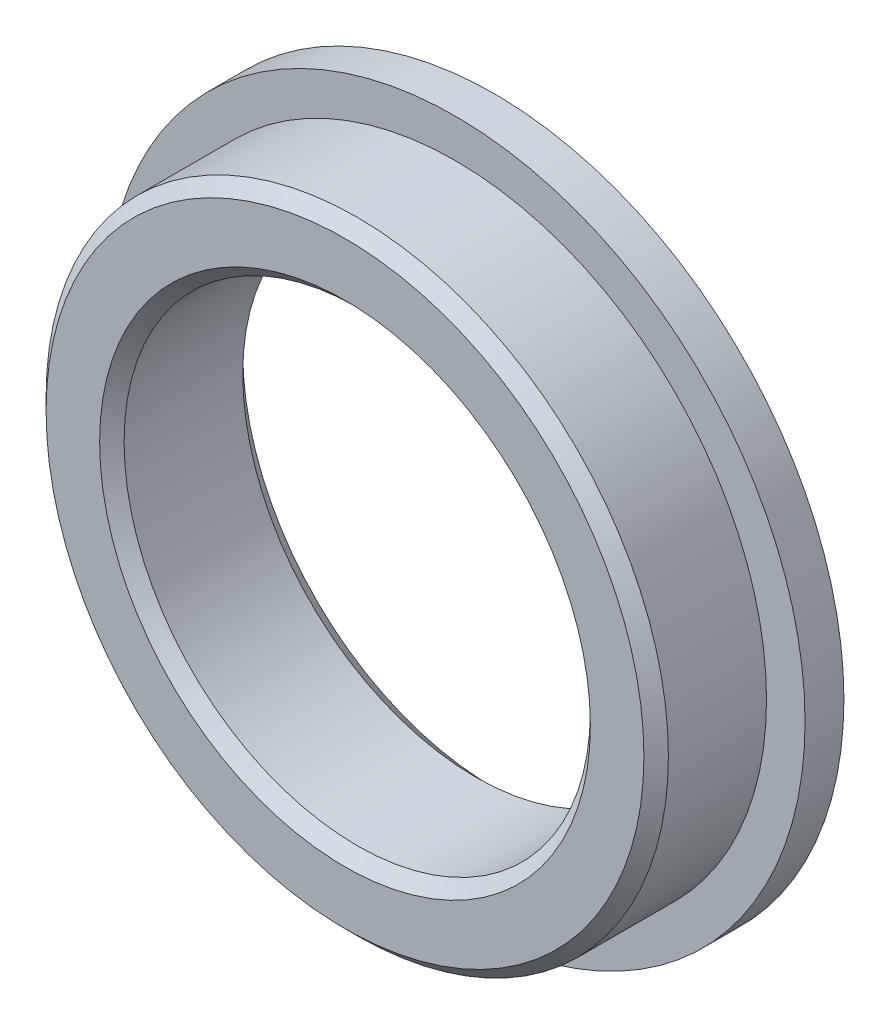
ISO-10303-21;
HEADER;
FILE_DESCRIPTION(('STEP AP214'),'2;1');
FILE_NAME('part.step','',(''),(''),'','','');
FILE_SCHEMA(('AUTOMOTIVE_DESIGN { 1 0 10303 214 1 1 1 1 }'));
ENDSEC;
DATA;
#1=APPLICATION_CONTEXT('core data for automotive mechanical design processes');
#2=APPLICATION_PROTOCOL_DEFINITION('international standard','automotive_design',2000,#1);
#3=PRODUCT_CONTEXT('',#1,'mechanical');
#4=PRODUCT('Part','Part','',(#3));
#5=PRODUCT_RELATED_PRODUCT_CATEGORY('part','',(#4));
#6=PRODUCT_DEFINITION_FORMATION('','',#4);
#7=PRODUCT_DEFINITION_CONTEXT('part definition',#1,'design');
#8=PRODUCT_DEFINITION('design','',#6,#7);
#9=PRODUCT_DEFINITION_SHAPE('','',#8);
#10=(LENGTH_UNIT() NAMED_UNIT(*) SI_UNIT(.MILLI.,.METRE.));
#11=(NAMED_UNIT(*) PLANE_ANGLE_UNIT() SI_UNIT($,.RADIAN.));
#12=(NAMED_UNIT(*) SI_UNIT($,.STERADIAN.) SOLID_ANGLE_UNIT());
#13=UNCERTAINTY_MEASURE_WITH_UNIT(LENGTH_MEASURE(1.E-05),#10,'distance_accuracy_value','');
#14=(GEOMETRIC_REPRESENTATION_CONTEXT(3) GLOBAL_UNCERTAINTY_ASSIGNED_CONTEXT((#13)) GLOBAL_UNIT_ASSIGNED_CONTEXT((#10,
#11,#12)) REPRESENTATION_CONTEXT('',''));
#15=CARTESIAN_POINT('',(0.,0.,0.));
#16=DIRECTION('',(0.,0.,1.));
#17=DIRECTION('',(1.,0.,0.));
#18=AXIS2_PLACEMENT_3D('',#15,#16,#17);
#19=CARTESIAN_POINT('',(0.,9.525,3.048));
#20=DIRECTION('',(0.,0.,-1.));
#21=DIRECTION('',(-1.,0.,0.));
#22=AXIS2_PLACEMENT_3D('',#19,#20,#21);
#23=PLANE('',#22);
#24=CARTESIAN_POINT('',(0.,0.,3.048));
#25=DIRECTION('',(0.,0.,-1.));
#26=DIRECTION('',(-1.,0.,0.));
#27=AXIS2_PLACEMENT_3D('',#24,#25,#26);
#28=CIRCLE('',#27,12.2127);
#29=CARTESIAN_POINT('',(-12.2127,0.,3.048));
#30=VERTEX_POINT('',#29);
#31=EDGE_CURVE('E17',#30,#30,#28,.T.);
#32=ORIENTED_EDGE('',*,*,#31,.F.);
#33=EDGE_LOOP('',(#32));
#34=FACE_BOUND('',#33,.T.);
#35=CARTESIAN_POINT('',(0.,0.,3.048));
#36=DIRECTION('',(0.,0.,1.));
#37=DIRECTION('',(1.,0.,0.));
#38=AXIS2_PLACEMENT_3D('',#35,#36,#37);
#39=CIRCLE('',#38,10.025);
#40=CARTESIAN_POINT('',(10.025,0.,3.048));
#41=VERTEX_POINT('',#40);
#42=EDGE_CURVE('E38',#41,#41,#39,.F.);
#43=ORIENTED_EDGE('',*,*,#42,.T.);
#44=EDGE_LOOP('',(#43));
#45=FACE_BOUND('',#44,.T.);
#46=ADVANCED_FACE('F14',(#34,#45),#23,.F.);
#47=CARTESIAN_POINT('',(0.,0.,2.548));
#48=DIRECTION('',(0.,0.,-1.));
#49=DIRECTION('',(-1.,0.,0.));
#50=AXIS2_PLACEMENT_3D('',#47,#48,#49);
#51=CONICAL_SURFACE('',#50,12.7127,0.785398163397447);
#52=CARTESIAN_POINT('',(0.,0.,2.548));
#53=DIRECTION('',(0.,0.,1.));
#54=DIRECTION('',(1.,0.,0.));
#55=AXIS2_PLACEMENT_3D('',#52,#53,#54);
#56=CIRCLE('',#55,12.7127);
#57=CARTESIAN_POINT('',(12.7127,0.,2.548));
#58=VERTEX_POINT('',#57);
#59=EDGE_CURVE('E29',#58,#58,#56,.F.);
#60=ORIENTED_EDGE('',*,*,#59,.F.);
#61=EDGE_LOOP('',(#60));
#62=FACE_BOUND('',#61,.T.);
#63=ORIENTED_EDGE('',*,*,#31,.T.);
#64=EDGE_LOOP('',(#63));
#65=FACE_BOUND('',#64,.T.);
#66=ADVANCED_FACE('F46',(#62,#65),#51,.T.);
#67=CARTESIAN_POINT('',(0.,0.,3.048));
#68=DIRECTION('',(0.,0.,1.));
#69=DIRECTION('',(1.,0.,0.));
#70=AXIS2_PLACEMENT_3D('',#67,#68,#69);
#71=CONICAL_SURFACE('',#70,10.025,0.785398163397446);
#72=ORIENTED_EDGE('',*,*,#42,.F.);
#73=EDGE_LOOP('',(#72));
#74=FACE_BOUND('',#73,.T.);
#75=CARTESIAN_POINT('',(0.,0.,2.54799999999999));
#76=DIRECTION('',(0.,0.,1.));
#77=DIRECTION('',(1.,0.,0.));
#78=AXIS2_PLACEMENT_3D('',#75,#76,#77);
#79=CIRCLE('',#78,9.525);
#80=CARTESIAN_POINT('',(9.525,0.,2.54799999999999));
#81=VERTEX_POINT('',#80);
#82=EDGE_CURVE('E37',#81,#81,#79,.F.);
#83=ORIENTED_EDGE('',*,*,#82,.T.);
#84=EDGE_LOOP('',(#83));
#85=FACE_BOUND('',#84,.T.);
#86=ADVANCED_FACE('F53',(#74,#85),#71,.F.);
#87=CARTESIAN_POINT('',(0.,0.,4.09575));
#88=DIRECTION('',(0.,0.,1.));
#89=DIRECTION('',(1.,0.,0.));
#90=AXIS2_PLACEMENT_3D('',#87,#88,#89);
#91=CYLINDRICAL_SURFACE('',#90,12.7127);
#92=ORIENTED_EDGE('',*,*,#59,.T.);
#93=EDGE_LOOP('',(#92));
#94=FACE_BOUND('',#93,.T.);
#95=CARTESIAN_POINT('',(0.,0.,-1.4605));
#96=DIRECTION('',(0.,0.,1.));
#97=DIRECTION('',(1.,0.,0.));
#98=AXIS2_PLACEMENT_3D('',#95,#96,#97);
#99=CIRCLE('',#98,12.7127);
#100=CARTESIAN_POINT('',(12.7127,0.,-1.4605));
#101=VERTEX_POINT('',#100);
#102=EDGE_CURVE('E35',#101,#101,#99,.T.);
#103=ORIENTED_EDGE('',*,*,#102,.T.);
#104=EDGE_LOOP('',(#103));
#105=FACE_BOUND('',#104,.T.);
#106=ADVANCED_FACE('F79',(#94,#105),#91,.T.);
#107=CARTESIAN_POINT('',(0.,0.,4.09575));
#108=DIRECTION('',(0.,0.,1.));
#109=DIRECTION('',(1.,0.,0.));
#110=AXIS2_PLACEMENT_3D('',#107,#108,#109);
#111=CYLINDRICAL_SURFACE('',#110,9.525);
#112=ORIENTED_EDGE('',*,*,#82,.F.);
#113=EDGE_LOOP('',(#112));
#114=FACE_BOUND('',#113,.T.);
#115=CARTESIAN_POINT('',(0.,0.,-2.298));
#116=DIRECTION('',(0.,0.,-1.));
#117=DIRECTION('',(-1.,0.,0.));
#118=AXIS2_PLACEMENT_3D('',#115,#116,#117);
#119=CIRCLE('',#118,9.525);
#120=CARTESIAN_POINT('',(-9.525,0.,-2.298));
#121=VERTEX_POINT('',#120);
#122=EDGE_CURVE('E34',#121,#121,#119,.T.);
#123=ORIENTED_EDGE('',*,*,#122,.T.);
#124=EDGE_LOOP('',(#123));
#125=FACE_BOUND('',#124,.T.);
#126=ADVANCED_FACE('F75',(#114,#125),#111,.F.);
#127=CARTESIAN_POINT('',(0.,12.7127,-1.4605));
#128=DIRECTION('',(0.,0.,-1.));
#129=DIRECTION('',(-1.,0.,0.));
#130=AXIS2_PLACEMENT_3D('',#127,#128,#129);
#131=PLANE('',#130);
#132=CARTESIAN_POINT('',(0.,0.,-1.4605));
#133=DIRECTION('',(0.,0.,1.));
#134=DIRECTION('',(1.,0.,0.));
#135=AXIS2_PLACEMENT_3D('',#132,#133,#134);
#136=CIRCLE('',#135,14.2875);
#137=CARTESIAN_POINT('',(14.2875,0.,-1.4605));
#138=VERTEX_POINT('',#137);
#139=EDGE_CURVE('E26',#138,#138,#136,.F.);
#140=ORIENTED_EDGE('',*,*,#139,.F.);
#141=EDGE_LOOP('',(#140));
#142=FACE_BOUND('',#141,.T.);
#143=ORIENTED_EDGE('',*,*,#102,.F.);
#144=EDGE_LOOP('',(#143));
#145=FACE_BOUND('',#144,.T.);
#146=ADVANCED_FACE('F71',(#142,#145),#131,.F.);
#147=CARTESIAN_POINT('',(0.,0.,-3.048));
#148=DIRECTION('',(0.,0.,-1.));
#149=DIRECTION('',(-1.,0.,0.));
#150=AXIS2_PLACEMENT_3D('',#147,#148,#149);
#151=CONICAL_SURFACE('',#150,10.275,0.785398163397446);
#152=CARTESIAN_POINT('',(0.,0.,-3.048));
#153=DIRECTION('',(0.,0.,-1.));
#154=DIRECTION('',(-1.,0.,0.));
#155=AXIS2_PLACEMENT_3D('',#152,#153,#154);
#156=CIRCLE('',#155,10.275);
#157=CARTESIAN_POINT('',(-10.275,0.,-3.048));
#158=VERTEX_POINT('',#157);
#159=EDGE_CURVE('E21',#158,#158,#156,.T.);
#160=ORIENTED_EDGE('',*,*,#159,.T.);
#161=EDGE_LOOP('',(#160));
#162=FACE_BOUND('',#161,.T.);
#163=ORIENTED_EDGE('',*,*,#122,.F.);
#164=EDGE_LOOP('',(#163));
#165=FACE_BOUND('',#164,.T.);
#166=ADVANCED_FACE('F64',(#162,#165),#151,.F.);
#167=CARTESIAN_POINT('',(0.,0.,4.09575));
#168=DIRECTION('',(0.,0.,1.));
#169=DIRECTION('',(1.,0.,0.));
#170=AXIS2_PLACEMENT_3D('',#167,#168,#169);
#171=CYLINDRICAL_SURFACE('',#170,14.2875);
#172=ORIENTED_EDGE('',*,*,#139,.T.);
#173=EDGE_LOOP('',(#172));
#174=FACE_BOUND('',#173,.T.);
#175=CARTESIAN_POINT('',(0.,0.,-3.048));
#176=DIRECTION('',(0.,0.,1.));
#177=DIRECTION('',(1.,0.,0.));
#178=AXIS2_PLACEMENT_3D('',#175,#176,#177);
#179=CIRCLE('',#178,14.2875);
#180=CARTESIAN_POINT('',(14.2875,0.,-3.048));
#181=VERTEX_POINT('',#180);
#182=EDGE_CURVE('E10',#181,#181,#179,.T.);
#183=ORIENTED_EDGE('',*,*,#182,.T.);
#184=EDGE_LOOP('',(#183));
#185=FACE_BOUND('',#184,.T.);
#186=ADVANCED_FACE('F57',(#174,#185),#171,.T.);
#187=CARTESIAN_POINT('',(0.,14.2875,-3.048));
#188=DIRECTION('',(0.,0.,1.));
#189=DIRECTION('',(1.,0.,0.));
#190=AXIS2_PLACEMENT_3D('',#187,#188,#189);
#191=PLANE('',#190);
#192=ORIENTED_EDGE('',*,*,#182,.F.);
#193=EDGE_LOOP('',(#192));
#194=FACE_BOUND('',#193,.T.);
#195=ORIENTED_EDGE('',*,*,#159,.F.);
#196=EDGE_LOOP('',(#195));
#197=FACE_BOUND('',#196,.T.);
#198=ADVANCED_FACE('F55',(#194,#197),#191,.F.);
#199=CLOSED_SHELL('',(#46,#66,#86,#106,#126,#146,#166,#186,#198));
#200=MANIFOLD_SOLID_BREP('B1',#199);
#201=ADVANCED_BREP_SHAPE_REPRESENTATION('',(#18,#200),#14);
#202=SHAPE_DEFINITION_REPRESENTATION(#9,#201);
ENDSEC;
END-ISO-10303-21;
